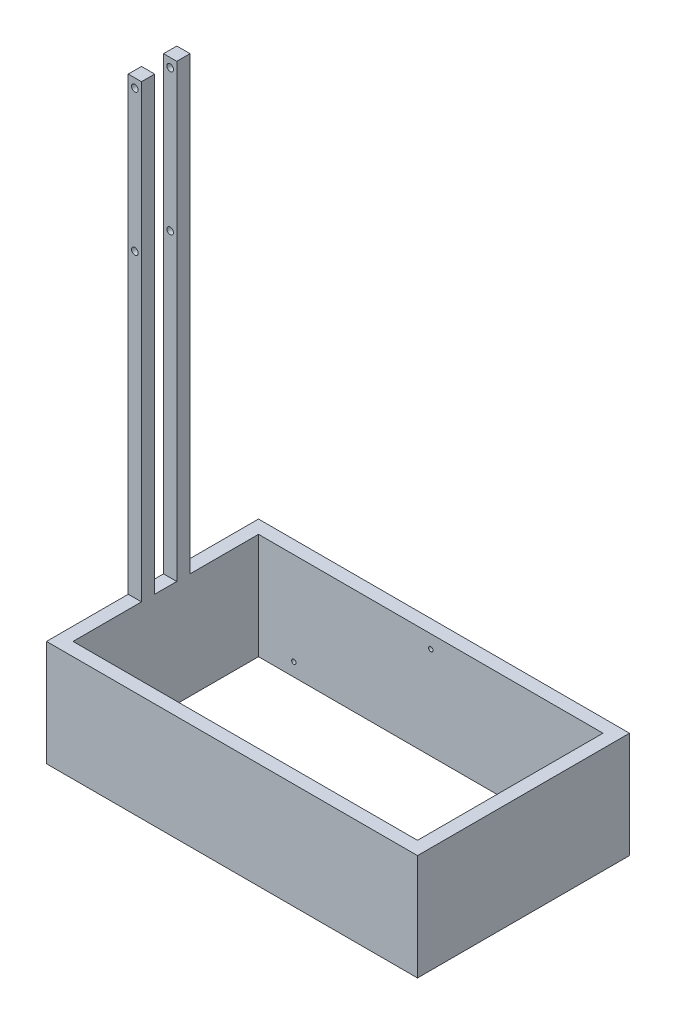
ISO-10303-21;
HEADER;
FILE_DESCRIPTION(('STEP AP214'),'2;1');
FILE_NAME('part.step','',(''),(''),'','','');
FILE_SCHEMA(('AUTOMOTIVE_DESIGN { 1 0 10303 214 1 1 1 1 }'));
ENDSEC;
DATA;
#1=APPLICATION_CONTEXT('core data for automotive mechanical design processes');
#2=APPLICATION_PROTOCOL_DEFINITION('international standard','automotive_design',2000,#1);
#3=PRODUCT_CONTEXT('',#1,'mechanical');
#4=PRODUCT('Part','Part','',(#3));
#5=PRODUCT_RELATED_PRODUCT_CATEGORY('part','',(#4));
#6=PRODUCT_DEFINITION_FORMATION('','',#4);
#7=PRODUCT_DEFINITION_CONTEXT('part definition',#1,'design');
#8=PRODUCT_DEFINITION('design','',#6,#7);
#9=PRODUCT_DEFINITION_SHAPE('','',#8);
#10=(LENGTH_UNIT() NAMED_UNIT(*) SI_UNIT(.MILLI.,.METRE.));
#11=(NAMED_UNIT(*) PLANE_ANGLE_UNIT() SI_UNIT($,.RADIAN.));
#12=(NAMED_UNIT(*) SI_UNIT($,.STERADIAN.) SOLID_ANGLE_UNIT());
#13=UNCERTAINTY_MEASURE_WITH_UNIT(LENGTH_MEASURE(1.E-05),#10,'distance_accuracy_value','');
#14=(GEOMETRIC_REPRESENTATION_CONTEXT(3) GLOBAL_UNCERTAINTY_ASSIGNED_CONTEXT((#13)) GLOBAL_UNIT_ASSIGNED_CONTEXT((#10,
#11,#12)) REPRESENTATION_CONTEXT('',''));
#15=CARTESIAN_POINT('',(0.,0.,0.));
#16=DIRECTION('',(0.,0.,1.));
#17=DIRECTION('',(1.,0.,0.));
#18=AXIS2_PLACEMENT_3D('',#15,#16,#17);
#19=CARTESIAN_POINT('',(0.,609.6,0.));
#20=DIRECTION('',(0.,-1.,0.));
#21=DIRECTION('',(0.,0.,-1.));
#22=AXIS2_PLACEMENT_3D('',#19,#20,#21);
#23=PLANE('',#22);
#24=DIRECTION('',(1.,0.,0.));
#25=VECTOR('',#24,1.);
#26=CARTESIAN_POINT('',(0.,609.6,-469.9));
#27=LINE('',#26,#25);
#28=CARTESIAN_POINT('',(0.,609.6,-469.9));
#29=VERTEX_POINT('',#28);
#30=CARTESIAN_POINT('',(76.2000000000001,609.6,-469.9));
#31=VERTEX_POINT('',#30);
#32=EDGE_CURVE('E274',#29,#31,#27,.T.);
#33=ORIENTED_EDGE('',*,*,#32,.F.);
#34=DIRECTION('',(0.,0.,1.));
#35=VECTOR('',#34,1.);
#36=CARTESIAN_POINT('',(0.,609.6,0.));
#37=LINE('',#36,#35);
#38=CARTESIAN_POINT('',(0.,609.6,0.));
#39=VERTEX_POINT('',#38);
#40=EDGE_CURVE('E171',#29,#39,#37,.T.);
#41=ORIENTED_EDGE('',*,*,#40,.T.);
#42=DIRECTION('',(1.,0.,0.));
#43=VECTOR('',#42,1.);
#44=CARTESIAN_POINT('',(0.,609.6,0.));
#45=LINE('',#44,#43);
#46=CARTESIAN_POINT('',(2133.6,609.6,0.));
#47=VERTEX_POINT('',#46);
#48=EDGE_CURVE('E260',#39,#47,#45,.T.);
#49=ORIENTED_EDGE('',*,*,#48,.T.);
#50=DIRECTION('',(0.,0.,-1.));
#51=VECTOR('',#50,1.);
#52=CARTESIAN_POINT('',(2133.6,609.6,0.));
#53=LINE('',#52,#51);
#54=CARTESIAN_POINT('',(2133.6,609.6,-1219.2));
#55=VERTEX_POINT('',#54);
#56=EDGE_CURVE('E258',#47,#55,#53,.T.);
#57=ORIENTED_EDGE('',*,*,#56,.T.);
#58=DIRECTION('',(-1.,0.,0.));
#59=VECTOR('',#58,1.);
#60=CARTESIAN_POINT('',(0.,609.6,-1219.2));
#61=LINE('',#60,#59);
#62=CARTESIAN_POINT('',(0.,609.6,-1219.2));
#63=VERTEX_POINT('',#62);
#64=EDGE_CURVE('E247',#55,#63,#61,.T.);
#65=ORIENTED_EDGE('',*,*,#64,.T.);
#66=CARTESIAN_POINT('',(0.,609.6,-749.3));
#67=VERTEX_POINT('',#66);
#68=EDGE_CURVE('E261',#63,#67,#37,.T.);
#69=ORIENTED_EDGE('',*,*,#68,.T.);
#70=DIRECTION('',(-1.,0.,0.));
#71=VECTOR('',#70,1.);
#72=CARTESIAN_POINT('',(0.,609.6,-749.3));
#73=LINE('',#72,#71);
#74=CARTESIAN_POINT('',(76.2000000000001,609.6,-749.3));
#75=VERTEX_POINT('',#74);
#76=EDGE_CURVE('E173',#75,#67,#73,.T.);
#77=ORIENTED_EDGE('',*,*,#76,.F.);
#78=DIRECTION('',(0.,0.,1.));
#79=VECTOR('',#78,1.);
#80=CARTESIAN_POINT('',(76.2,609.6,-1143.));
#81=LINE('',#80,#79);
#82=CARTESIAN_POINT('',(76.2,609.6,-1143.));
#83=VERTEX_POINT('',#82);
#84=EDGE_CURVE('E236',#83,#75,#81,.T.);
#85=ORIENTED_EDGE('',*,*,#84,.F.);
#86=DIRECTION('',(-1.,0.,0.));
#87=VECTOR('',#86,1.);
#88=CARTESIAN_POINT('',(76.2,609.6,-1143.));
#89=LINE('',#88,#87);
#90=CARTESIAN_POINT('',(2057.4,609.6,-1143.));
#91=VERTEX_POINT('',#90);
#92=EDGE_CURVE('E310',#91,#83,#89,.T.);
#93=ORIENTED_EDGE('',*,*,#92,.F.);
#94=DIRECTION('',(0.,0.,-1.));
#95=VECTOR('',#94,1.);
#96=CARTESIAN_POINT('',(2057.4,609.6,-1143.));
#97=LINE('',#96,#95);
#98=CARTESIAN_POINT('',(2057.4,609.6,-76.2));
#99=VERTEX_POINT('',#98);
#100=EDGE_CURVE('E314',#99,#91,#97,.T.);
#101=ORIENTED_EDGE('',*,*,#100,.F.);
#102=DIRECTION('',(1.,0.,0.));
#103=VECTOR('',#102,1.);
#104=CARTESIAN_POINT('',(76.2000000000002,609.6,-76.2));
#105=LINE('',#104,#103);
#106=CARTESIAN_POINT('',(76.2000000000002,609.6,-76.2));
#107=VERTEX_POINT('',#106);
#108=EDGE_CURVE('E230',#107,#99,#105,.T.);
#109=ORIENTED_EDGE('',*,*,#108,.F.);
#110=EDGE_CURVE('E220',#31,#107,#81,.T.);
#111=ORIENTED_EDGE('',*,*,#110,.F.);
#112=EDGE_LOOP('',(#33,#41,#49,#57,#65,#69,#77,#85,#93,#101,#109,#111));
#113=FACE_BOUND('',#112,.T.);
#114=ADVANCED_FACE('F34',(#113),#23,.F.);
#115=DIRECTION('',(-1.,0.,0.));
#116=VECTOR('',#115,1.);
#117=CARTESIAN_POINT('',(0.,609.6,-546.1));
#118=LINE('',#117,#116);
#119=CARTESIAN_POINT('',(76.2,609.6,-546.1));
#120=VERTEX_POINT('',#119);
#121=CARTESIAN_POINT('',(0.,609.6,-546.1));
#122=VERTEX_POINT('',#121);
#123=EDGE_CURVE('E166',#120,#122,#118,.T.);
#124=ORIENTED_EDGE('',*,*,#123,.F.);
#125=CARTESIAN_POINT('',(76.2,609.6,-673.1));
#126=VERTEX_POINT('',#125);
#127=EDGE_CURVE('E223',#126,#120,#81,.T.);
#128=ORIENTED_EDGE('',*,*,#127,.F.);
#129=DIRECTION('',(1.,0.,0.));
#130=VECTOR('',#129,1.);
#131=CARTESIAN_POINT('',(0.,609.6,-673.1));
#132=LINE('',#131,#130);
#133=CARTESIAN_POINT('',(0.,609.6,-673.1));
#134=VERTEX_POINT('',#133);
#135=EDGE_CURVE('E59',#134,#126,#132,.T.);
#136=ORIENTED_EDGE('',*,*,#135,.F.);
#137=EDGE_CURVE('E195',#134,#122,#37,.T.);
#138=ORIENTED_EDGE('',*,*,#137,.T.);
#139=EDGE_LOOP('',(#124,#128,#136,#138));
#140=FACE_BOUND('',#139,.T.);
#141=ADVANCED_FACE('F402',(#140),#23,.F.);
#142=CARTESIAN_POINT('',(0.,609.6,0.));
#143=DIRECTION('',(1.,0.,0.));
#144=DIRECTION('',(0.,0.,-1.));
#145=AXIS2_PLACEMENT_3D('',#142,#143,#144);
#146=PLANE('',#145);
#147=DIRECTION('',(0.,0.,1.));
#148=VECTOR('',#147,1.);
#149=CARTESIAN_POINT('',(0.,0.,0.));
#150=LINE('',#149,#148);
#151=CARTESIAN_POINT('',(0.,0.,-1219.2));
#152=VERTEX_POINT('',#151);
#153=CARTESIAN_POINT('',(0.,0.,0.));
#154=VERTEX_POINT('',#153);
#155=EDGE_CURVE('E254',#152,#154,#150,.T.);
#156=ORIENTED_EDGE('',*,*,#155,.T.);
#157=DIRECTION('',(0.,-1.,0.));
#158=VECTOR('',#157,1.);
#159=CARTESIAN_POINT('',(0.,609.6,0.));
#160=LINE('',#159,#158);
#161=EDGE_CURVE('E11',#39,#154,#160,.T.);
#162=ORIENTED_EDGE('',*,*,#161,.F.);
#163=ORIENTED_EDGE('',*,*,#40,.F.);
#164=DIRECTION('',(0.,-1.,0.));
#165=VECTOR('',#164,1.);
#166=CARTESIAN_POINT('',(0.,3200.4,-469.9));
#167=LINE('',#166,#165);
#168=CARTESIAN_POINT('',(0.,3200.4,-469.9));
#169=VERTEX_POINT('',#168);
#170=EDGE_CURVE('E153',#169,#29,#167,.T.);
#171=ORIENTED_EDGE('',*,*,#170,.F.);
#172=DIRECTION('',(0.,0.,1.));
#173=VECTOR('',#172,1.);
#174=CARTESIAN_POINT('',(0.,3200.4,-546.1));
#175=LINE('',#174,#173);
#176=CARTESIAN_POINT('',(0.,3200.4,-546.1));
#177=VERTEX_POINT('',#176);
#178=EDGE_CURVE('E157',#177,#169,#175,.T.);
#179=ORIENTED_EDGE('',*,*,#178,.F.);
#180=DIRECTION('',(0.,-1.,0.));
#181=VECTOR('',#180,1.);
#182=CARTESIAN_POINT('',(0.,3200.4,-546.1));
#183=LINE('',#182,#181);
#184=EDGE_CURVE('E717',#177,#122,#183,.T.);
#185=ORIENTED_EDGE('',*,*,#184,.T.);
#186=ORIENTED_EDGE('',*,*,#137,.F.);
#187=DIRECTION('',(0.,-1.,0.));
#188=VECTOR('',#187,1.);
#189=CARTESIAN_POINT('',(0.,3200.4,-673.1));
#190=LINE('',#189,#188);
#191=CARTESIAN_POINT('',(0.,3200.4,-673.1));
#192=VERTEX_POINT('',#191);
#193=EDGE_CURVE('E201',#192,#134,#190,.T.);
#194=ORIENTED_EDGE('',*,*,#193,.F.);
#195=DIRECTION('',(0.,0.,1.));
#196=VECTOR('',#195,1.);
#197=CARTESIAN_POINT('',(0.,3200.4,-749.3));
#198=LINE('',#197,#196);
#199=CARTESIAN_POINT('',(0.,3200.4,-749.3));
#200=VERTEX_POINT('',#199);
#201=EDGE_CURVE('E179',#200,#192,#198,.T.);
#202=ORIENTED_EDGE('',*,*,#201,.F.);
#203=DIRECTION('',(0.,-1.,0.));
#204=VECTOR('',#203,1.);
#205=CARTESIAN_POINT('',(0.,3200.4,-749.3));
#206=LINE('',#205,#204);
#207=EDGE_CURVE('E188',#200,#67,#206,.T.);
#208=ORIENTED_EDGE('',*,*,#207,.T.);
#209=ORIENTED_EDGE('',*,*,#68,.F.);
#210=DIRECTION('',(0.,-1.,0.));
#211=VECTOR('',#210,1.);
#212=CARTESIAN_POINT('',(0.,609.6,-1219.2));
#213=LINE('',#212,#211);
#214=EDGE_CURVE('E244',#63,#152,#213,.T.);
#215=ORIENTED_EDGE('',*,*,#214,.T.);
#216=EDGE_LOOP('',(#156,#162,#163,#171,#179,#185,#186,#194,#202,#208,#209,#215));
#217=FACE_BOUND('',#216,.T.);
#218=ADVANCED_FACE('F36',(#217),#146,.F.);
#219=CARTESIAN_POINT('',(0.,609.6,0.));
#220=DIRECTION('',(0.,0.,-1.));
#221=DIRECTION('',(-1.,0.,0.));
#222=AXIS2_PLACEMENT_3D('',#219,#220,#221);
#223=PLANE('',#222);
#224=DIRECTION('',(1.,0.,0.));
#225=VECTOR('',#224,1.);
#226=CARTESIAN_POINT('',(0.,0.,0.));
#227=LINE('',#226,#225);
#228=CARTESIAN_POINT('',(2133.6,0.,0.));
#229=VERTEX_POINT('',#228);
#230=EDGE_CURVE('E252',#154,#229,#227,.T.);
#231=ORIENTED_EDGE('',*,*,#230,.T.);
#232=DIRECTION('',(0.,-1.,0.));
#233=VECTOR('',#232,1.);
#234=CARTESIAN_POINT('',(2133.6,609.6,0.));
#235=LINE('',#234,#233);
#236=EDGE_CURVE('E43',#47,#229,#235,.T.);
#237=ORIENTED_EDGE('',*,*,#236,.F.);
#238=ORIENTED_EDGE('',*,*,#48,.F.);
#239=ORIENTED_EDGE('',*,*,#161,.T.);
#240=EDGE_LOOP('',(#231,#237,#238,#239));
#241=FACE_BOUND('',#240,.T.);
#242=ADVANCED_FACE('F276',(#241),#223,.F.);
#243=CARTESIAN_POINT('',(2133.6,609.6,0.));
#244=DIRECTION('',(-1.,0.,0.));
#245=DIRECTION('',(0.,0.,1.));
#246=AXIS2_PLACEMENT_3D('',#243,#244,#245);
#247=PLANE('',#246);
#248=DIRECTION('',(0.,0.,-1.));
#249=VECTOR('',#248,1.);
#250=CARTESIAN_POINT('',(2133.6,0.,0.));
#251=LINE('',#250,#249);
#252=CARTESIAN_POINT('',(2133.6,0.,-1219.2));
#253=VERTEX_POINT('',#252);
#254=EDGE_CURVE('E250',#229,#253,#251,.T.);
#255=ORIENTED_EDGE('',*,*,#254,.T.);
#256=DIRECTION('',(0.,-1.,0.));
#257=VECTOR('',#256,1.);
#258=CARTESIAN_POINT('',(2133.6,609.6,-1219.2));
#259=LINE('',#258,#257);
#260=EDGE_CURVE('E241',#55,#253,#259,.T.);
#261=ORIENTED_EDGE('',*,*,#260,.F.);
#262=ORIENTED_EDGE('',*,*,#56,.F.);
#263=ORIENTED_EDGE('',*,*,#236,.T.);
#264=EDGE_LOOP('',(#255,#261,#262,#263));
#265=FACE_BOUND('',#264,.T.);
#266=ADVANCED_FACE('F285',(#265),#247,.F.);
#267=CARTESIAN_POINT('',(0.,609.6,-1219.2));
#268=DIRECTION('',(0.,0.,1.));
#269=DIRECTION('',(1.,0.,0.));
#270=AXIS2_PLACEMENT_3D('',#267,#268,#269);
#271=PLANE('',#270);
#272=DIRECTION('',(-1.,0.,0.));
#273=VECTOR('',#272,1.);
#274=CARTESIAN_POINT('',(0.,0.,-1219.2));
#275=LINE('',#274,#273);
#276=EDGE_CURVE('E248',#253,#152,#275,.T.);
#277=ORIENTED_EDGE('',*,*,#276,.T.);
#278=ORIENTED_EDGE('',*,*,#214,.F.);
#279=ORIENTED_EDGE('',*,*,#64,.F.);
#280=ORIENTED_EDGE('',*,*,#260,.T.);
#281=EDGE_LOOP('',(#277,#278,#279,#280));
#282=FACE_BOUND('',#281,.T.);
#283=ADVANCED_FACE('F289',(#282),#271,.F.);
#284=CARTESIAN_POINT('',(0.,0.,0.));
#285=DIRECTION('',(0.,-1.,0.));
#286=DIRECTION('',(0.,0.,-1.));
#287=AXIS2_PLACEMENT_3D('',#284,#285,#286);
#288=PLANE('',#287);
#289=DIRECTION('',(0.,0.,1.));
#290=VECTOR('',#289,1.);
#291=CARTESIAN_POINT('',(76.2,0.,-1143.));
#292=LINE('',#291,#290);
#293=CARTESIAN_POINT('',(76.2,0.,-1143.));
#294=VERTEX_POINT('',#293);
#295=CARTESIAN_POINT('',(76.2000000000002,0.,-76.2));
#296=VERTEX_POINT('',#295);
#297=EDGE_CURVE('E304',#294,#296,#292,.T.);
#298=ORIENTED_EDGE('',*,*,#297,.T.);
#299=DIRECTION('',(1.,0.,0.));
#300=VECTOR('',#299,1.);
#301=CARTESIAN_POINT('',(76.2000000000002,0.,-76.2));
#302=LINE('',#301,#300);
#303=CARTESIAN_POINT('',(2057.4,0.,-76.2));
#304=VERTEX_POINT('',#303);
#305=EDGE_CURVE('E316',#296,#304,#302,.T.);
#306=ORIENTED_EDGE('',*,*,#305,.T.);
#307=DIRECTION('',(0.,0.,-1.));
#308=VECTOR('',#307,1.);
#309=CARTESIAN_POINT('',(2057.4,0.,-1143.));
#310=LINE('',#309,#308);
#311=CARTESIAN_POINT('',(2057.4,0.,-1143.));
#312=VERTEX_POINT('',#311);
#313=EDGE_CURVE('E327',#304,#312,#310,.T.);
#314=ORIENTED_EDGE('',*,*,#313,.T.);
#315=DIRECTION('',(-1.,0.,0.));
#316=VECTOR('',#315,1.);
#317=CARTESIAN_POINT('',(76.2,0.,-1143.));
#318=LINE('',#317,#316);
#319=EDGE_CURVE('E228',#312,#294,#318,.T.);
#320=ORIENTED_EDGE('',*,*,#319,.T.);
#321=EDGE_LOOP('',(#298,#306,#314,#320));
#322=FACE_BOUND('',#321,.T.);
#323=ORIENTED_EDGE('',*,*,#155,.F.);
#324=ORIENTED_EDGE('',*,*,#276,.F.);
#325=ORIENTED_EDGE('',*,*,#254,.F.);
#326=ORIENTED_EDGE('',*,*,#230,.F.);
#327=EDGE_LOOP('',(#323,#324,#325,#326));
#328=FACE_BOUND('',#327,.T.);
#329=ADVANCED_FACE('F282',(#322,#328),#288,.T.);
#330=CARTESIAN_POINT('',(76.2,0.,-1143.));
#331=DIRECTION('',(-1.,0.,0.));
#332=DIRECTION('',(0.,0.,1.));
#333=AXIS2_PLACEMENT_3D('',#330,#331,#332);
#334=PLANE('',#333);
#335=ORIENTED_EDGE('',*,*,#84,.T.);
#336=DIRECTION('',(0.,-1.,0.));
#337=VECTOR('',#336,1.);
#338=CARTESIAN_POINT('',(76.2000000000001,3200.4,-749.3));
#339=LINE('',#338,#337);
#340=CARTESIAN_POINT('',(76.2000000000001,3200.4,-749.3));
#341=VERTEX_POINT('',#340);
#342=EDGE_CURVE('E202',#341,#75,#339,.T.);
#343=ORIENTED_EDGE('',*,*,#342,.F.);
#344=DIRECTION('',(0.,0.,-1.));
#345=VECTOR('',#344,1.);
#346=CARTESIAN_POINT('',(76.2000000000001,3200.4,-749.3));
#347=LINE('',#346,#345);
#348=CARTESIAN_POINT('',(76.2,3200.4,-673.1));
#349=VERTEX_POINT('',#348);
#350=EDGE_CURVE('E184',#349,#341,#347,.T.);
#351=ORIENTED_EDGE('',*,*,#350,.F.);
#352=DIRECTION('',(0.,-1.,0.));
#353=VECTOR('',#352,1.);
#354=CARTESIAN_POINT('',(76.2,3200.4,-673.1));
#355=LINE('',#354,#353);
#356=EDGE_CURVE('E198',#349,#126,#355,.T.);
#357=ORIENTED_EDGE('',*,*,#356,.T.);
#358=ORIENTED_EDGE('',*,*,#127,.T.);
#359=DIRECTION('',(0.,-1.,0.));
#360=VECTOR('',#359,1.);
#361=CARTESIAN_POINT('',(76.2,3200.4,-546.1));
#362=LINE('',#361,#360);
#363=CARTESIAN_POINT('',(76.2,3200.4,-546.1));
#364=VERTEX_POINT('',#363);
#365=EDGE_CURVE('E175',#364,#120,#362,.T.);
#366=ORIENTED_EDGE('',*,*,#365,.F.);
#367=DIRECTION('',(0.,0.,-1.));
#368=VECTOR('',#367,1.);
#369=CARTESIAN_POINT('',(76.2,3200.4,-546.1));
#370=LINE('',#369,#368);
#371=CARTESIAN_POINT('',(76.2,3200.4,-469.9));
#372=VERTEX_POINT('',#371);
#373=EDGE_CURVE('E156',#372,#364,#370,.T.);
#374=ORIENTED_EDGE('',*,*,#373,.F.);
#375=DIRECTION('',(0.,-1.,0.));
#376=VECTOR('',#375,1.);
#377=CARTESIAN_POINT('',(76.2,3200.4,-469.9));
#378=LINE('',#377,#376);
#379=EDGE_CURVE('E51',#372,#31,#378,.T.);
#380=ORIENTED_EDGE('',*,*,#379,.T.);
#381=ORIENTED_EDGE('',*,*,#110,.T.);
#382=DIRECTION('',(0.,1.,0.));
#383=VECTOR('',#382,1.);
#384=CARTESIAN_POINT('',(76.2000000000002,0.,-76.2));
#385=LINE('',#384,#383);
#386=EDGE_CURVE('E264',#296,#107,#385,.T.);
#387=ORIENTED_EDGE('',*,*,#386,.F.);
#388=ORIENTED_EDGE('',*,*,#297,.F.);
#389=DIRECTION('',(0.,1.,0.));
#390=VECTOR('',#389,1.);
#391=CARTESIAN_POINT('',(76.2,0.,-1143.));
#392=LINE('',#391,#390);
#393=EDGE_CURVE('E256',#294,#83,#392,.T.);
#394=ORIENTED_EDGE('',*,*,#393,.T.);
#395=EDGE_LOOP('',(#335,#343,#351,#357,#358,#366,#374,#380,#381,#387,#388,#394));
#396=FACE_BOUND('',#395,.T.);
#397=ADVANCED_FACE('F299',(#396),#334,.F.);
#398=CARTESIAN_POINT('',(76.2,0.,-1143.));
#399=DIRECTION('',(0.,0.,-1.));
#400=DIRECTION('',(-1.,0.,0.));
#401=AXIS2_PLACEMENT_3D('',#398,#399,#400);
#402=PLANE('',#401);
#403=CARTESIAN_POINT('',(1066.8,533.4,-1143.));
#404=DIRECTION('',(0.,0.,1.));
#405=DIRECTION('',(1.,0.,0.));
#406=AXIS2_PLACEMENT_3D('',#403,#404,#405);
#407=CIRCLE('',#406,12.6999999999999);
#408=CARTESIAN_POINT('',(1079.5,533.4,-1143.));
#409=VERTEX_POINT('',#408);
#410=EDGE_CURVE('E207',#409,#409,#407,.T.);
#411=ORIENTED_EDGE('',*,*,#410,.F.);
#412=EDGE_LOOP('',(#411));
#413=FACE_BOUND('',#412,.T.);
#414=CARTESIAN_POINT('',(279.4,76.2,-1143.));
#415=DIRECTION('',(0.,0.,1.));
#416=DIRECTION('',(1.,0.,0.));
#417=AXIS2_PLACEMENT_3D('',#414,#415,#416);
#418=CIRCLE('',#417,12.7);
#419=CARTESIAN_POINT('',(292.1,76.2,-1143.));
#420=VERTEX_POINT('',#419);
#421=EDGE_CURVE('E351',#420,#420,#418,.T.);
#422=ORIENTED_EDGE('',*,*,#421,.F.);
#423=EDGE_LOOP('',(#422));
#424=FACE_BOUND('',#423,.T.);
#425=CARTESIAN_POINT('',(1854.2,76.2,-1143.));
#426=DIRECTION('',(0.,0.,1.));
#427=DIRECTION('',(1.,0.,0.));
#428=AXIS2_PLACEMENT_3D('',#425,#426,#427);
#429=CIRCLE('',#428,12.6999999999999);
#430=CARTESIAN_POINT('',(1866.9,76.2,-1143.));
#431=VERTEX_POINT('',#430);
#432=EDGE_CURVE('E345',#431,#431,#429,.T.);
#433=ORIENTED_EDGE('',*,*,#432,.F.);
#434=EDGE_LOOP('',(#433));
#435=FACE_BOUND('',#434,.T.);
#436=ORIENTED_EDGE('',*,*,#92,.T.);
#437=ORIENTED_EDGE('',*,*,#393,.F.);
#438=ORIENTED_EDGE('',*,*,#319,.F.);
#439=DIRECTION('',(0.,1.,0.));
#440=VECTOR('',#439,1.);
#441=CARTESIAN_POINT('',(2057.4,0.,-1143.));
#442=LINE('',#441,#440);
#443=EDGE_CURVE('E308',#312,#91,#442,.T.);
#444=ORIENTED_EDGE('',*,*,#443,.T.);
#445=EDGE_LOOP('',(#436,#437,#438,#444));
#446=FACE_BOUND('',#445,.T.);
#447=ADVANCED_FACE('F311',(#413,#424,#435,#446),#402,.F.);
#448=CARTESIAN_POINT('',(2057.4,0.,-1143.));
#449=DIRECTION('',(1.,0.,0.));
#450=DIRECTION('',(0.,0.,-1.));
#451=AXIS2_PLACEMENT_3D('',#448,#449,#450);
#452=PLANE('',#451);
#453=ORIENTED_EDGE('',*,*,#100,.T.);
#454=ORIENTED_EDGE('',*,*,#443,.F.);
#455=ORIENTED_EDGE('',*,*,#313,.F.);
#456=DIRECTION('',(0.,1.,0.));
#457=VECTOR('',#456,1.);
#458=CARTESIAN_POINT('',(2057.4,0.,-76.2));
#459=LINE('',#458,#457);
#460=EDGE_CURVE('E319',#304,#99,#459,.T.);
#461=ORIENTED_EDGE('',*,*,#460,.T.);
#462=EDGE_LOOP('',(#453,#454,#455,#461));
#463=FACE_BOUND('',#462,.T.);
#464=ADVANCED_FACE('F378',(#463),#452,.F.);
#465=CARTESIAN_POINT('',(76.2000000000002,0.,-76.2));
#466=DIRECTION('',(0.,0.,1.));
#467=DIRECTION('',(1.,0.,0.));
#468=AXIS2_PLACEMENT_3D('',#465,#466,#467);
#469=PLANE('',#468);
#470=CARTESIAN_POINT('',(1066.8,533.4,-76.2));
#471=DIRECTION('',(0.,0.,-1.));
#472=DIRECTION('',(-1.,0.,0.));
#473=AXIS2_PLACEMENT_3D('',#470,#471,#472);
#474=CIRCLE('',#473,12.6999999999999);
#475=CARTESIAN_POINT('',(1054.1,533.4,-76.2));
#476=VERTEX_POINT('',#475);
#477=EDGE_CURVE('E357',#476,#476,#474,.T.);
#478=ORIENTED_EDGE('',*,*,#477,.F.);
#479=EDGE_LOOP('',(#478));
#480=FACE_BOUND('',#479,.T.);
#481=CARTESIAN_POINT('',(1854.2,76.2,-76.2));
#482=DIRECTION('',(0.,0.,-1.));
#483=DIRECTION('',(-1.,0.,0.));
#484=AXIS2_PLACEMENT_3D('',#481,#482,#483);
#485=CIRCLE('',#484,12.6999999999999);
#486=CARTESIAN_POINT('',(1841.5,76.2,-76.2));
#487=VERTEX_POINT('',#486);
#488=EDGE_CURVE('E339',#487,#487,#485,.T.);
#489=ORIENTED_EDGE('',*,*,#488,.F.);
#490=EDGE_LOOP('',(#489));
#491=FACE_BOUND('',#490,.T.);
#492=CARTESIAN_POINT('',(279.4,76.2,-76.2));
#493=DIRECTION('',(0.,0.,-1.));
#494=DIRECTION('',(-1.,0.,0.));
#495=AXIS2_PLACEMENT_3D('',#492,#493,#494);
#496=CIRCLE('',#495,12.7);
#497=CARTESIAN_POINT('',(266.7,76.2,-76.2));
#498=VERTEX_POINT('',#497);
#499=EDGE_CURVE('E333',#498,#498,#496,.T.);
#500=ORIENTED_EDGE('',*,*,#499,.F.);
#501=EDGE_LOOP('',(#500));
#502=FACE_BOUND('',#501,.T.);
#503=ORIENTED_EDGE('',*,*,#108,.T.);
#504=ORIENTED_EDGE('',*,*,#460,.F.);
#505=ORIENTED_EDGE('',*,*,#305,.F.);
#506=ORIENTED_EDGE('',*,*,#386,.T.);
#507=EDGE_LOOP('',(#503,#504,#505,#506));
#508=FACE_BOUND('',#507,.T.);
#509=ADVANCED_FACE('F484',(#480,#491,#502,#508),#469,.F.);
#510=CARTESIAN_POINT('',(279.4,76.2,-25.4));
#511=DIRECTION('',(0.,0.,-1.));
#512=DIRECTION('',(-1.,0.,0.));
#513=AXIS2_PLACEMENT_3D('',#510,#511,#512);
#514=CYLINDRICAL_SURFACE('',#513,12.7);
#515=CARTESIAN_POINT('',(279.4,76.2,-25.4));
#516=DIRECTION('',(0.,0.,-1.));
#517=DIRECTION('',(-1.,0.,0.));
#518=AXIS2_PLACEMENT_3D('',#515,#516,#517);
#519=CIRCLE('',#518,12.7);
#520=CARTESIAN_POINT('',(266.7,76.2,-25.4));
#521=VERTEX_POINT('',#520);
#522=EDGE_CURVE('E224',#521,#521,#519,.T.);
#523=ORIENTED_EDGE('',*,*,#522,.F.);
#524=EDGE_LOOP('',(#523));
#525=FACE_BOUND('',#524,.T.);
#526=ORIENTED_EDGE('',*,*,#499,.T.);
#527=EDGE_LOOP('',(#526));
#528=FACE_BOUND('',#527,.T.);
#529=ADVANCED_FACE('F489',(#525,#528),#514,.F.);
#530=CARTESIAN_POINT('',(279.4,76.2,-25.4));
#531=DIRECTION('',(0.,0.,-1.));
#532=DIRECTION('',(-1.,0.,0.));
#533=AXIS2_PLACEMENT_3D('',#530,#531,#532);
#534=PLANE('',#533);
#535=ORIENTED_EDGE('',*,*,#522,.T.);
#536=EDGE_LOOP('',(#535));
#537=FACE_BOUND('',#536,.T.);
#538=ADVANCED_FACE('F532',(#537),#534,.T.);
#539=CARTESIAN_POINT('',(1854.2,76.2,-25.4));
#540=DIRECTION('',(0.,0.,-1.));
#541=DIRECTION('',(-1.,0.,0.));
#542=AXIS2_PLACEMENT_3D('',#539,#540,#541);
#543=CYLINDRICAL_SURFACE('',#542,12.6999999999999);
#544=CARTESIAN_POINT('',(1854.2,76.2,-25.4));
#545=DIRECTION('',(0.,0.,-1.));
#546=DIRECTION('',(-1.,0.,0.));
#547=AXIS2_PLACEMENT_3D('',#544,#545,#546);
#548=CIRCLE('',#547,12.6999999999999);
#549=CARTESIAN_POINT('',(1841.5,76.2,-25.4));
#550=VERTEX_POINT('',#549);
#551=EDGE_CURVE('E336',#550,#550,#548,.T.);
#552=ORIENTED_EDGE('',*,*,#551,.F.);
#553=EDGE_LOOP('',(#552));
#554=FACE_BOUND('',#553,.T.);
#555=ORIENTED_EDGE('',*,*,#488,.T.);
#556=EDGE_LOOP('',(#555));
#557=FACE_BOUND('',#556,.T.);
#558=ADVANCED_FACE('F397',(#554,#557),#543,.F.);
#559=CARTESIAN_POINT('',(1854.2,76.2,-25.4));
#560=DIRECTION('',(0.,0.,-1.));
#561=DIRECTION('',(-1.,0.,0.));
#562=AXIS2_PLACEMENT_3D('',#559,#560,#561);
#563=PLANE('',#562);
#564=ORIENTED_EDGE('',*,*,#551,.T.);
#565=EDGE_LOOP('',(#564));
#566=FACE_BOUND('',#565,.T.);
#567=ADVANCED_FACE('F387',(#566),#563,.T.);
#568=CARTESIAN_POINT('',(1854.2,76.2,-1193.8));
#569=DIRECTION('',(0.,0.,1.));
#570=DIRECTION('',(1.,0.,0.));
#571=AXIS2_PLACEMENT_3D('',#568,#569,#570);
#572=CYLINDRICAL_SURFACE('',#571,12.6999999999999);
#573=CARTESIAN_POINT('',(1854.2,76.2,-1193.8));
#574=DIRECTION('',(0.,0.,1.));
#575=DIRECTION('',(1.,0.,0.));
#576=AXIS2_PLACEMENT_3D('',#573,#574,#575);
#577=CIRCLE('',#576,12.6999999999999);
#578=CARTESIAN_POINT('',(1866.9,76.2,-1193.8));
#579=VERTEX_POINT('',#578);
#580=EDGE_CURVE('E342',#579,#579,#577,.T.);
#581=ORIENTED_EDGE('',*,*,#580,.F.);
#582=EDGE_LOOP('',(#581));
#583=FACE_BOUND('',#582,.T.);
#584=ORIENTED_EDGE('',*,*,#432,.T.);
#585=EDGE_LOOP('',(#584));
#586=FACE_BOUND('',#585,.T.);
#587=ADVANCED_FACE('F384',(#583,#586),#572,.F.);
#588=CARTESIAN_POINT('',(1854.2,76.2,-1193.8));
#589=DIRECTION('',(0.,0.,1.));
#590=DIRECTION('',(1.,0.,0.));
#591=AXIS2_PLACEMENT_3D('',#588,#589,#590);
#592=PLANE('',#591);
#593=ORIENTED_EDGE('',*,*,#580,.T.);
#594=EDGE_LOOP('',(#593));
#595=FACE_BOUND('',#594,.T.);
#596=ADVANCED_FACE('F386',(#595),#592,.T.);
#597=CARTESIAN_POINT('',(279.4,76.2,-1193.8));
#598=DIRECTION('',(0.,0.,1.));
#599=DIRECTION('',(1.,0.,0.));
#600=AXIS2_PLACEMENT_3D('',#597,#598,#599);
#601=CYLINDRICAL_SURFACE('',#600,12.7);
#602=CARTESIAN_POINT('',(279.4,76.2,-1193.8));
#603=DIRECTION('',(0.,0.,1.));
#604=DIRECTION('',(1.,0.,0.));
#605=AXIS2_PLACEMENT_3D('',#602,#603,#604);
#606=CIRCLE('',#605,12.7);
#607=CARTESIAN_POINT('',(292.1,76.2,-1193.8));
#608=VERTEX_POINT('',#607);
#609=EDGE_CURVE('E348',#608,#608,#606,.T.);
#610=ORIENTED_EDGE('',*,*,#609,.F.);
#611=EDGE_LOOP('',(#610));
#612=FACE_BOUND('',#611,.T.);
#613=ORIENTED_EDGE('',*,*,#421,.T.);
#614=EDGE_LOOP('',(#613));
#615=FACE_BOUND('',#614,.T.);
#616=ADVANCED_FACE('F394',(#612,#615),#601,.F.);
#617=CARTESIAN_POINT('',(279.4,76.2,-1193.8));
#618=DIRECTION('',(0.,0.,1.));
#619=DIRECTION('',(1.,0.,0.));
#620=AXIS2_PLACEMENT_3D('',#617,#618,#619);
#621=PLANE('',#620);
#622=ORIENTED_EDGE('',*,*,#609,.T.);
#623=EDGE_LOOP('',(#622));
#624=FACE_BOUND('',#623,.T.);
#625=ADVANCED_FACE('F476',(#624),#621,.T.);
#626=CARTESIAN_POINT('',(1066.8,533.4,-25.4));
#627=DIRECTION('',(0.,0.,-1.));
#628=DIRECTION('',(-1.,0.,0.));
#629=AXIS2_PLACEMENT_3D('',#626,#627,#628);
#630=CYLINDRICAL_SURFACE('',#629,12.6999999999999);
#631=CARTESIAN_POINT('',(1066.8,533.4,-25.4));
#632=DIRECTION('',(0.,0.,-1.));
#633=DIRECTION('',(-1.,0.,0.));
#634=AXIS2_PLACEMENT_3D('',#631,#632,#633);
#635=CIRCLE('',#634,12.6999999999999);
#636=CARTESIAN_POINT('',(1054.1,533.4,-25.4));
#637=VERTEX_POINT('',#636);
#638=EDGE_CURVE('E354',#637,#637,#635,.T.);
#639=ORIENTED_EDGE('',*,*,#638,.F.);
#640=EDGE_LOOP('',(#639));
#641=FACE_BOUND('',#640,.T.);
#642=ORIENTED_EDGE('',*,*,#477,.T.);
#643=EDGE_LOOP('',(#642));
#644=FACE_BOUND('',#643,.T.);
#645=ADVANCED_FACE('F466',(#641,#644),#630,.F.);
#646=CARTESIAN_POINT('',(1066.8,533.4,-25.4));
#647=DIRECTION('',(0.,0.,-1.));
#648=DIRECTION('',(-1.,0.,0.));
#649=AXIS2_PLACEMENT_3D('',#646,#647,#648);
#650=PLANE('',#649);
#651=ORIENTED_EDGE('',*,*,#638,.T.);
#652=EDGE_LOOP('',(#651));
#653=FACE_BOUND('',#652,.T.);
#654=ADVANCED_FACE('F372',(#653),#650,.T.);
#655=CARTESIAN_POINT('',(1066.8,533.4,-1193.8));
#656=DIRECTION('',(0.,0.,1.));
#657=DIRECTION('',(1.,0.,0.));
#658=AXIS2_PLACEMENT_3D('',#655,#656,#657);
#659=CYLINDRICAL_SURFACE('',#658,12.6999999999999);
#660=CARTESIAN_POINT('',(1066.8,533.4,-1193.8));
#661=DIRECTION('',(0.,0.,1.));
#662=DIRECTION('',(1.,0.,0.));
#663=AXIS2_PLACEMENT_3D('',#660,#661,#662);
#664=CIRCLE('',#663,12.6999999999999);
#665=CARTESIAN_POINT('',(1079.5,533.4,-1193.8));
#666=VERTEX_POINT('',#665);
#667=EDGE_CURVE('E360',#666,#666,#664,.T.);
#668=ORIENTED_EDGE('',*,*,#667,.F.);
#669=EDGE_LOOP('',(#668));
#670=FACE_BOUND('',#669,.T.);
#671=ORIENTED_EDGE('',*,*,#410,.T.);
#672=EDGE_LOOP('',(#671));
#673=FACE_BOUND('',#672,.T.);
#674=ADVANCED_FACE('F369',(#670,#673),#659,.F.);
#675=CARTESIAN_POINT('',(1066.8,533.4,-1193.8));
#676=DIRECTION('',(0.,0.,1.));
#677=DIRECTION('',(1.,0.,0.));
#678=AXIS2_PLACEMENT_3D('',#675,#676,#677);
#679=PLANE('',#678);
#680=ORIENTED_EDGE('',*,*,#667,.T.);
#681=EDGE_LOOP('',(#680));
#682=FACE_BOUND('',#681,.T.);
#683=ADVANCED_FACE('F367',(#682),#679,.T.);
#684=CARTESIAN_POINT('',(0.,3200.4,-673.1));
#685=DIRECTION('',(0.,0.,-1.));
#686=DIRECTION('',(-1.,0.,0.));
#687=AXIS2_PLACEMENT_3D('',#684,#685,#686);
#688=PLANE('',#687);
#689=CARTESIAN_POINT('',(38.1000000000001,3149.6,-673.1));
#690=DIRECTION('',(0.,0.,-1.));
#691=DIRECTION('',(-1.,0.,0.));
#692=AXIS2_PLACEMENT_3D('',#689,#690,#691);
#693=CIRCLE('',#692,19.0500000000002);
#694=CARTESIAN_POINT('',(19.0499999999999,3149.6,-673.1));
#695=VERTEX_POINT('',#694);
#696=EDGE_CURVE('E698',#695,#695,#693,.T.);
#697=ORIENTED_EDGE('',*,*,#696,.T.);
#698=EDGE_LOOP('',(#697));
#699=FACE_BOUND('',#698,.T.);
#700=CARTESIAN_POINT('',(38.1,2336.8,-673.1));
#701=DIRECTION('',(0.,0.,-1.));
#702=DIRECTION('',(-1.,0.,0.));
#703=AXIS2_PLACEMENT_3D('',#700,#701,#702);
#704=CIRCLE('',#703,19.0500000000002);
#705=CARTESIAN_POINT('',(19.0499999999999,2336.8,-673.1));
#706=VERTEX_POINT('',#705);
#707=EDGE_CURVE('E712',#706,#706,#704,.T.);
#708=ORIENTED_EDGE('',*,*,#707,.T.);
#709=EDGE_LOOP('',(#708));
#710=FACE_BOUND('',#709,.T.);
#711=ORIENTED_EDGE('',*,*,#135,.T.);
#712=ORIENTED_EDGE('',*,*,#356,.F.);
#713=DIRECTION('',(1.,0.,0.));
#714=VECTOR('',#713,1.);
#715=CARTESIAN_POINT('',(0.,3200.4,-673.1));
#716=LINE('',#715,#714);
#717=EDGE_CURVE('E182',#192,#349,#716,.T.);
#718=ORIENTED_EDGE('',*,*,#717,.F.);
#719=ORIENTED_EDGE('',*,*,#193,.T.);
#720=EDGE_LOOP('',(#711,#712,#718,#719));
#721=FACE_BOUND('',#720,.T.);
#722=ADVANCED_FACE('F440',(#699,#710,#721),#688,.F.);
#723=CARTESIAN_POINT('',(0.,3200.4,-749.3));
#724=DIRECTION('',(0.,0.,1.));
#725=DIRECTION('',(1.,0.,0.));
#726=AXIS2_PLACEMENT_3D('',#723,#724,#725);
#727=PLANE('',#726);
#728=CARTESIAN_POINT('',(38.1000000000001,3149.6,-749.3));
#729=DIRECTION('',(0.,0.,-1.));
#730=DIRECTION('',(-1.,0.,0.));
#731=AXIS2_PLACEMENT_3D('',#728,#729,#730);
#732=CIRCLE('',#731,19.0500000000002);
#733=CARTESIAN_POINT('',(19.0499999999999,3149.6,-749.3));
#734=VERTEX_POINT('',#733);
#735=EDGE_CURVE('E695',#734,#734,#732,.T.);
#736=ORIENTED_EDGE('',*,*,#735,.F.);
#737=EDGE_LOOP('',(#736));
#738=FACE_BOUND('',#737,.T.);
#739=CARTESIAN_POINT('',(38.1,2336.8,-749.3));
#740=DIRECTION('',(0.,0.,1.));
#741=DIRECTION('',(1.,0.,0.));
#742=AXIS2_PLACEMENT_3D('',#739,#740,#741);
#743=CIRCLE('',#742,19.0500000000002);
#744=CARTESIAN_POINT('',(57.1500000000002,2336.8,-749.3));
#745=VERTEX_POINT('',#744);
#746=EDGE_CURVE('E709',#745,#745,#743,.T.);
#747=ORIENTED_EDGE('',*,*,#746,.T.);
#748=EDGE_LOOP('',(#747));
#749=FACE_BOUND('',#748,.T.);
#750=ORIENTED_EDGE('',*,*,#76,.T.);
#751=ORIENTED_EDGE('',*,*,#207,.F.);
#752=DIRECTION('',(-1.,0.,0.));
#753=VECTOR('',#752,1.);
#754=CARTESIAN_POINT('',(0.,3200.4,-749.3));
#755=LINE('',#754,#753);
#756=EDGE_CURVE('E186',#341,#200,#755,.T.);
#757=ORIENTED_EDGE('',*,*,#756,.F.);
#758=ORIENTED_EDGE('',*,*,#342,.T.);
#759=EDGE_LOOP('',(#750,#751,#757,#758));
#760=FACE_BOUND('',#759,.T.);
#761=ADVANCED_FACE('F295',(#738,#749,#760),#727,.F.);
#762=CARTESIAN_POINT('',(0.,3200.4,0.));
#763=DIRECTION('',(0.,1.,0.));
#764=DIRECTION('',(0.,0.,1.));
#765=AXIS2_PLACEMENT_3D('',#762,#763,#764);
#766=PLANE('',#765);
#767=ORIENTED_EDGE('',*,*,#201,.T.);
#768=ORIENTED_EDGE('',*,*,#717,.T.);
#769=ORIENTED_EDGE('',*,*,#350,.T.);
#770=ORIENTED_EDGE('',*,*,#756,.T.);
#771=EDGE_LOOP('',(#767,#768,#769,#770));
#772=FACE_BOUND('',#771,.T.);
#773=ADVANCED_FACE('F615',(#772),#766,.T.);
#774=CARTESIAN_POINT('',(0.,3200.4,-469.9));
#775=DIRECTION('',(0.,0.,-1.));
#776=DIRECTION('',(-1.,0.,0.));
#777=AXIS2_PLACEMENT_3D('',#774,#775,#776);
#778=PLANE('',#777);
#779=CARTESIAN_POINT('',(38.1000000000001,3149.6,-469.9));
#780=DIRECTION('',(0.,0.,-1.));
#781=DIRECTION('',(-1.,0.,0.));
#782=AXIS2_PLACEMENT_3D('',#779,#780,#781);
#783=CIRCLE('',#782,19.0500000000002);
#784=CARTESIAN_POINT('',(19.0499999999999,3149.6,-469.9));
#785=VERTEX_POINT('',#784);
#786=EDGE_CURVE('E700',#785,#785,#783,.T.);
#787=ORIENTED_EDGE('',*,*,#786,.T.);
#788=EDGE_LOOP('',(#787));
#789=FACE_BOUND('',#788,.T.);
#790=CARTESIAN_POINT('',(38.1,2336.8,-469.9));
#791=DIRECTION('',(0.,0.,1.));
#792=DIRECTION('',(1.,0.,0.));
#793=AXIS2_PLACEMENT_3D('',#790,#791,#792);
#794=CIRCLE('',#793,19.0500000000002);
#795=CARTESIAN_POINT('',(57.1500000000002,2336.8,-469.9));
#796=VERTEX_POINT('',#795);
#797=EDGE_CURVE('E699',#796,#796,#794,.T.);
#798=ORIENTED_EDGE('',*,*,#797,.F.);
#799=EDGE_LOOP('',(#798));
#800=FACE_BOUND('',#799,.T.);
#801=ORIENTED_EDGE('',*,*,#32,.T.);
#802=ORIENTED_EDGE('',*,*,#379,.F.);
#803=DIRECTION('',(1.,0.,0.));
#804=VECTOR('',#803,1.);
#805=CARTESIAN_POINT('',(0.,3200.4,-469.9));
#806=LINE('',#805,#804);
#807=EDGE_CURVE('E149',#169,#372,#806,.T.);
#808=ORIENTED_EDGE('',*,*,#807,.F.);
#809=ORIENTED_EDGE('',*,*,#170,.T.);
#810=EDGE_LOOP('',(#801,#802,#808,#809));
#811=FACE_BOUND('',#810,.T.);
#812=ADVANCED_FACE('F151',(#789,#800,#811),#778,.F.);
#813=CARTESIAN_POINT('',(0.,3200.4,-546.1));
#814=DIRECTION('',(0.,0.,1.));
#815=DIRECTION('',(1.,0.,0.));
#816=AXIS2_PLACEMENT_3D('',#813,#814,#815);
#817=PLANE('',#816);
#818=CARTESIAN_POINT('',(38.1000000000001,3149.6,-546.1));
#819=DIRECTION('',(0.,0.,1.));
#820=DIRECTION('',(1.,0.,0.));
#821=AXIS2_PLACEMENT_3D('',#818,#819,#820);
#822=CIRCLE('',#821,19.0500000000002);
#823=CARTESIAN_POINT('',(57.1500000000002,3149.6,-546.1));
#824=VERTEX_POINT('',#823);
#825=EDGE_CURVE('E38',#824,#824,#822,.T.);
#826=ORIENTED_EDGE('',*,*,#825,.T.);
#827=EDGE_LOOP('',(#826));
#828=FACE_BOUND('',#827,.T.);
#829=CARTESIAN_POINT('',(38.1,2336.8,-546.1));
#830=DIRECTION('',(0.,0.,1.));
#831=DIRECTION('',(1.,0.,0.));
#832=AXIS2_PLACEMENT_3D('',#829,#830,#831);
#833=CIRCLE('',#832,19.0500000000002);
#834=CARTESIAN_POINT('',(57.1500000000002,2336.8,-546.1));
#835=VERTEX_POINT('',#834);
#836=EDGE_CURVE('E703',#835,#835,#833,.T.);
#837=ORIENTED_EDGE('',*,*,#836,.T.);
#838=EDGE_LOOP('',(#837));
#839=FACE_BOUND('',#838,.T.);
#840=ORIENTED_EDGE('',*,*,#123,.T.);
#841=ORIENTED_EDGE('',*,*,#184,.F.);
#842=DIRECTION('',(-1.,0.,0.));
#843=VECTOR('',#842,1.);
#844=CARTESIAN_POINT('',(0.,3200.4,-546.1));
#845=LINE('',#844,#843);
#846=EDGE_CURVE('E162',#364,#177,#845,.T.);
#847=ORIENTED_EDGE('',*,*,#846,.F.);
#848=ORIENTED_EDGE('',*,*,#365,.T.);
#849=EDGE_LOOP('',(#840,#841,#847,#848));
#850=FACE_BOUND('',#849,.T.);
#851=ADVANCED_FACE('F632',(#828,#839,#850),#817,.F.);
#852=CARTESIAN_POINT('',(0.,3200.4,0.));
#853=DIRECTION('',(0.,1.,0.));
#854=DIRECTION('',(0.,0.,1.));
#855=AXIS2_PLACEMENT_3D('',#852,#853,#854);
#856=PLANE('',#855);
#857=ORIENTED_EDGE('',*,*,#178,.T.);
#858=ORIENTED_EDGE('',*,*,#807,.T.);
#859=ORIENTED_EDGE('',*,*,#373,.T.);
#860=ORIENTED_EDGE('',*,*,#846,.T.);
#861=EDGE_LOOP('',(#857,#858,#859,#860));
#862=FACE_BOUND('',#861,.T.);
#863=ADVANCED_FACE('F160',(#862),#856,.T.);
#864=CARTESIAN_POINT('',(38.1,2336.8,-3060.7));
#865=DIRECTION('',(0.,0.,1.));
#866=DIRECTION('',(1.,0.,0.));
#867=AXIS2_PLACEMENT_3D('',#864,#865,#866);
#868=CYLINDRICAL_SURFACE('',#867,19.0500000000002);
#869=ORIENTED_EDGE('',*,*,#797,.T.);
#870=EDGE_LOOP('',(#869));
#871=FACE_BOUND('',#870,.T.);
#872=ORIENTED_EDGE('',*,*,#836,.F.);
#873=EDGE_LOOP('',(#872));
#874=FACE_BOUND('',#873,.T.);
#875=ADVANCED_FACE('F649',(#871,#874),#868,.F.);
#876=ORIENTED_EDGE('',*,*,#746,.F.);
#877=EDGE_LOOP('',(#876));
#878=FACE_BOUND('',#877,.T.);
#879=ORIENTED_EDGE('',*,*,#707,.F.);
#880=EDGE_LOOP('',(#879));
#881=FACE_BOUND('',#880,.T.);
#882=ADVANCED_FACE('F657',(#878,#881),#868,.F.);
#883=CARTESIAN_POINT('',(38.1000000000001,3149.6,774.7));
#884=DIRECTION('',(0.,0.,-1.));
#885=DIRECTION('',(-1.,0.,0.));
#886=AXIS2_PLACEMENT_3D('',#883,#884,#885);
#887=CYLINDRICAL_SURFACE('',#886,19.0500000000002);
#888=ORIENTED_EDGE('',*,*,#825,.F.);
#889=EDGE_LOOP('',(#888));
#890=FACE_BOUND('',#889,.T.);
#891=ORIENTED_EDGE('',*,*,#786,.F.);
#892=EDGE_LOOP('',(#891));
#893=FACE_BOUND('',#892,.T.);
#894=ADVANCED_FACE('F665',(#890,#893),#887,.F.);
#895=ORIENTED_EDGE('',*,*,#735,.T.);
#896=EDGE_LOOP('',(#895));
#897=FACE_BOUND('',#896,.T.);
#898=ORIENTED_EDGE('',*,*,#696,.F.);
#899=EDGE_LOOP('',(#898));
#900=FACE_BOUND('',#899,.T.);
#901=ADVANCED_FACE('F672',(#897,#900),#887,.F.);
#902=CLOSED_SHELL('',(#114,#141,#218,#242,#266,#283,#329,#397,#447,#464,#509,#529,#538,#558,
#567,#587,#596,#616,#625,#645,#654,#674,#683,#722,#761,#773,#812,#851,#863,#875,#882,#894,#901));
#903=MANIFOLD_SOLID_BREP('B2',#902);
#904=ADVANCED_BREP_SHAPE_REPRESENTATION('',(#18,#903),#14);
#905=SHAPE_DEFINITION_REPRESENTATION(#9,#904);
ENDSEC;
END-ISO-10303-21;
